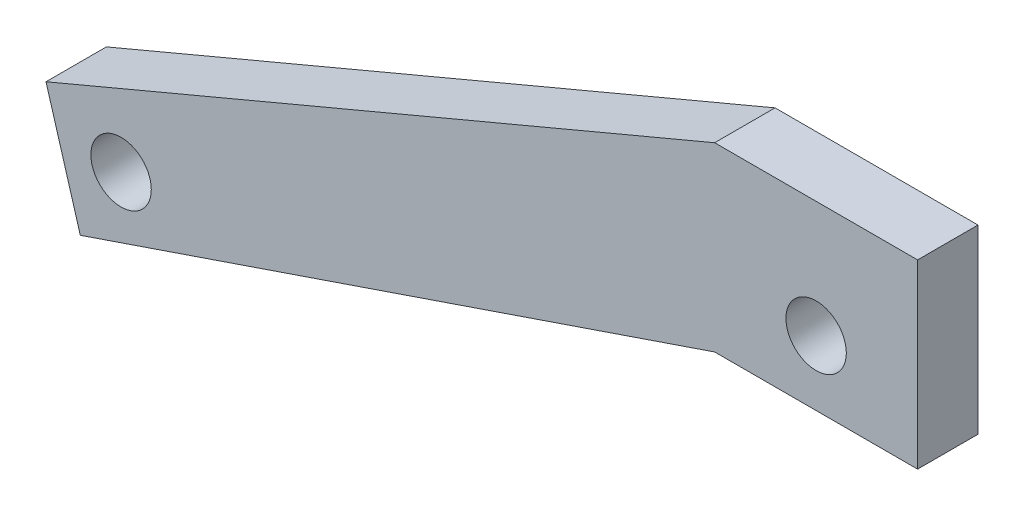
ISO-10303-21;
HEADER;
FILE_DESCRIPTION(('STEP AP214'),'2;1');
FILE_NAME('part.step','',(''),(''),'','','');
FILE_SCHEMA(('AUTOMOTIVE_DESIGN { 1 0 10303 214 1 1 1 1 }'));
ENDSEC;
DATA;
#1=APPLICATION_CONTEXT('core data for automotive mechanical design processes');
#2=APPLICATION_PROTOCOL_DEFINITION('international standard','automotive_design',2000,#1);
#3=PRODUCT_CONTEXT('',#1,'mechanical');
#4=PRODUCT('Part','Part','',(#3));
#5=PRODUCT_RELATED_PRODUCT_CATEGORY('part','',(#4));
#6=PRODUCT_DEFINITION_FORMATION('','',#4);
#7=PRODUCT_DEFINITION_CONTEXT('part definition',#1,'design');
#8=PRODUCT_DEFINITION('design','',#6,#7);
#9=PRODUCT_DEFINITION_SHAPE('','',#8);
#10=(LENGTH_UNIT() NAMED_UNIT(*) SI_UNIT(.MILLI.,.METRE.));
#11=(NAMED_UNIT(*) PLANE_ANGLE_UNIT() SI_UNIT($,.RADIAN.));
#12=(NAMED_UNIT(*) SI_UNIT($,.STERADIAN.) SOLID_ANGLE_UNIT());
#13=UNCERTAINTY_MEASURE_WITH_UNIT(LENGTH_MEASURE(1.E-05),#10,'distance_accuracy_value','');
#14=(GEOMETRIC_REPRESENTATION_CONTEXT(3) GLOBAL_UNCERTAINTY_ASSIGNED_CONTEXT((#13)) GLOBAL_UNIT_ASSIGNED_CONTEXT((#10,
#11,#12)) REPRESENTATION_CONTEXT('',''));
#15=CARTESIAN_POINT('',(0.,0.,0.));
#16=DIRECTION('',(0.,0.,1.));
#17=DIRECTION('',(1.,0.,0.));
#18=AXIS2_PLACEMENT_3D('',#15,#16,#17);
#19=CARTESIAN_POINT('',(-181.897226624623,-53.8804132223541,9.525));
#20=DIRECTION('',(-0.958819734868243,-0.284015344703754,0.));
#21=DIRECTION('',(0.284015344703754,-0.958819734868243,0.));
#22=AXIS2_PLACEMENT_3D('',#19,#20,#21);
#23=PLANE('',#22);
#24=DIRECTION('',(-0.284015344703754,0.958819734868243,0.));
#25=VECTOR('',#24,1.);
#26=CARTESIAN_POINT('',(-181.897226624623,-53.8804132223541,0.));
#27=LINE('',#26,#25);
#28=CARTESIAN_POINT('',(-211.250903159401,45.2159380041662,0.));
#29=VERTEX_POINT('',#28);
#30=CARTESIAN_POINT('',(-216.661395476008,63.4814539534063,0.));
#31=VERTEX_POINT('',#30);
#32=EDGE_CURVE('E130',#29,#31,#27,.T.);
#33=ORIENTED_EDGE('',*,*,#32,.F.);
#34=DIRECTION('',(0.,0.,-1.));
#35=VECTOR('',#34,1.);
#36=CARTESIAN_POINT('',(-211.250903159401,45.2159380041662,9.525));
#37=LINE('',#36,#35);
#38=CARTESIAN_POINT('',(-211.250903159401,45.2159380041662,9.525));
#39=VERTEX_POINT('',#38);
#40=EDGE_CURVE('E11',#39,#29,#37,.T.);
#41=ORIENTED_EDGE('',*,*,#40,.F.);
#42=DIRECTION('',(-0.284015344703754,0.958819734868243,0.));
#43=VECTOR('',#42,1.);
#44=CARTESIAN_POINT('',(-181.897226624623,-53.8804132223541,9.525));
#45=LINE('',#44,#43);
#46=CARTESIAN_POINT('',(-216.661395476008,63.4814539534063,9.525));
#47=VERTEX_POINT('',#46);
#48=EDGE_CURVE('E238',#39,#47,#45,.T.);
#49=ORIENTED_EDGE('',*,*,#48,.T.);
#50=DIRECTION('',(0.,0.,-1.));
#51=VECTOR('',#50,1.);
#52=CARTESIAN_POINT('',(-216.661395476008,63.4814539534063,9.525));
#53=LINE('',#52,#51);
#54=EDGE_CURVE('E80',#47,#31,#53,.T.);
#55=ORIENTED_EDGE('',*,*,#54,.T.);
#56=EDGE_LOOP('',(#33,#41,#49,#55));
#57=FACE_BOUND('',#56,.T.);
#58=ADVANCED_FACE('F35',(#57),#23,.T.);
#59=CARTESIAN_POINT('',(-35.7758008350263,105.002644647187,9.525));
#60=DIRECTION('',(0.322507916242878,-0.946566766773838,0.));
#61=DIRECTION('',(0.946566766773838,0.322507916242878,0.));
#62=AXIS2_PLACEMENT_3D('',#59,#60,#61);
#63=PLANE('',#62);
#64=DIRECTION('',(-0.946566766773838,-0.322507916242878,0.));
#65=VECTOR('',#64,1.);
#66=CARTESIAN_POINT('',(-35.7758008350263,105.002644647187,0.));
#67=LINE('',#66,#65);
#68=CARTESIAN_POINT('',(-111.230275822276,79.2942991257426,0.));
#69=VERTEX_POINT('',#68);
#70=EDGE_CURVE('E128',#69,#29,#67,.T.);
#71=ORIENTED_EDGE('',*,*,#70,.F.);
#72=DIRECTION('',(0.,0.,-1.));
#73=VECTOR('',#72,1.);
#74=CARTESIAN_POINT('',(-111.230275822276,79.2942991257426,9.525));
#75=LINE('',#74,#73);
#76=CARTESIAN_POINT('',(-111.230275822276,79.2942991257426,9.525));
#77=VERTEX_POINT('',#76);
#78=EDGE_CURVE('E44',#77,#69,#75,.T.);
#79=ORIENTED_EDGE('',*,*,#78,.F.);
#80=DIRECTION('',(-0.946566766773838,-0.322507916242878,0.));
#81=VECTOR('',#80,1.);
#82=CARTESIAN_POINT('',(-35.7758008350263,105.002644647187,9.525));
#83=LINE('',#82,#81);
#84=EDGE_CURVE('E239',#77,#39,#83,.T.);
#85=ORIENTED_EDGE('',*,*,#84,.T.);
#86=ORIENTED_EDGE('',*,*,#40,.T.);
#87=EDGE_LOOP('',(#71,#79,#85,#86));
#88=FACE_BOUND('',#87,.T.);
#89=ADVANCED_FACE('F129',(#88),#63,.T.);
#90=CARTESIAN_POINT('',(0.,79.2942991257426,9.525));
#91=DIRECTION('',(0.,-1.,0.));
#92=DIRECTION('',(1.,0.,0.));
#93=AXIS2_PLACEMENT_3D('',#90,#91,#92);
#94=PLANE('',#93);
#95=DIRECTION('',(-1.,0.,0.));
#96=VECTOR('',#95,1.);
#97=CARTESIAN_POINT('',(0.,79.2942991257426,0.));
#98=LINE('',#97,#96);
#99=CARTESIAN_POINT('',(-79.2302758222756,79.2942991257426,0.));
#100=VERTEX_POINT('',#99);
#101=EDGE_CURVE('E124',#100,#69,#98,.T.);
#102=ORIENTED_EDGE('',*,*,#101,.F.);
#103=DIRECTION('',(0.,0.,-1.));
#104=VECTOR('',#103,1.);
#105=CARTESIAN_POINT('',(-79.2302758222756,79.2942991257426,9.525));
#106=LINE('',#105,#104);
#107=CARTESIAN_POINT('',(-79.2302758222756,79.2942991257426,9.525));
#108=VERTEX_POINT('',#107);
#109=EDGE_CURVE('E114',#108,#100,#106,.T.);
#110=ORIENTED_EDGE('',*,*,#109,.F.);
#111=DIRECTION('',(-1.,0.,0.));
#112=VECTOR('',#111,1.);
#113=CARTESIAN_POINT('',(0.,79.2942991257426,9.525));
#114=LINE('',#113,#112);
#115=EDGE_CURVE('E108',#108,#77,#114,.T.);
#116=ORIENTED_EDGE('',*,*,#115,.T.);
#117=ORIENTED_EDGE('',*,*,#78,.T.);
#118=EDGE_LOOP('',(#102,#110,#116,#117));
#119=FACE_BOUND('',#118,.T.);
#120=ADVANCED_FACE('F122',(#119),#94,.T.);
#121=CARTESIAN_POINT('',(-79.2302758222756,0.,9.525));
#122=DIRECTION('',(-1.,0.,0.));
#123=DIRECTION('',(0.,-1.,0.));
#124=AXIS2_PLACEMENT_3D('',#121,#122,#123);
#125=PLANE('',#124);
#126=DIRECTION('',(0.,1.,0.));
#127=VECTOR('',#126,1.);
#128=CARTESIAN_POINT('',(-79.2302758222756,0.,0.));
#129=LINE('',#128,#127);
#130=CARTESIAN_POINT('',(-79.2302758222756,107.869299125743,0.));
#131=VERTEX_POINT('',#130);
#132=EDGE_CURVE('E113',#100,#131,#129,.T.);
#133=ORIENTED_EDGE('',*,*,#132,.T.);
#134=DIRECTION('',(0.,0.,-1.));
#135=VECTOR('',#134,1.);
#136=CARTESIAN_POINT('',(-79.2302758222756,107.869299125743,9.525));
#137=LINE('',#136,#135);
#138=CARTESIAN_POINT('',(-79.2302758222756,107.869299125743,9.525));
#139=VERTEX_POINT('',#138);
#140=EDGE_CURVE('E98',#139,#131,#137,.T.);
#141=ORIENTED_EDGE('',*,*,#140,.F.);
#142=DIRECTION('',(0.,1.,0.));
#143=VECTOR('',#142,1.);
#144=CARTESIAN_POINT('',(-79.2302758222756,0.,9.525));
#145=LINE('',#144,#143);
#146=EDGE_CURVE('E101',#108,#139,#145,.T.);
#147=ORIENTED_EDGE('',*,*,#146,.F.);
#148=ORIENTED_EDGE('',*,*,#109,.T.);
#149=EDGE_LOOP('',(#133,#141,#147,#148));
#150=FACE_BOUND('',#149,.T.);
#151=ADVANCED_FACE('F111',(#150),#125,.F.);
#152=CARTESIAN_POINT('',(1.77767235254067E-11,107.86929912573,9.525));
#153=DIRECTION('',(-1.64798730217823E-13,-1.,0.));
#154=DIRECTION('',(1.,-1.64798730217823E-13,0.));
#155=AXIS2_PLACEMENT_3D('',#152,#153,#154);
#156=PLANE('',#155);
#157=DIRECTION('',(-1.,1.64798730217823E-13,0.));
#158=VECTOR('',#157,1.);
#159=CARTESIAN_POINT('',(1.77767235254067E-11,107.86929912573,0.));
#160=LINE('',#159,#158);
#161=CARTESIAN_POINT('',(-111.230275822271,107.869299125748,0.));
#162=VERTEX_POINT('',#161);
#163=EDGE_CURVE('E134',#131,#162,#160,.T.);
#164=ORIENTED_EDGE('',*,*,#163,.T.);
#165=DIRECTION('',(0.,0.,-1.));
#166=VECTOR('',#165,1.);
#167=CARTESIAN_POINT('',(-111.230275822271,107.869299125748,9.525));
#168=LINE('',#167,#166);
#169=CARTESIAN_POINT('',(-111.230275822271,107.869299125748,9.525));
#170=VERTEX_POINT('',#169);
#171=EDGE_CURVE('E100',#170,#162,#168,.T.);
#172=ORIENTED_EDGE('',*,*,#171,.F.);
#173=DIRECTION('',(-1.,1.64798730217823E-13,0.));
#174=VECTOR('',#173,1.);
#175=CARTESIAN_POINT('',(1.77767235254067E-11,107.86929912573,9.525));
#176=LINE('',#175,#174);
#177=EDGE_CURVE('E93',#139,#170,#176,.T.);
#178=ORIENTED_EDGE('',*,*,#177,.F.);
#179=ORIENTED_EDGE('',*,*,#140,.T.);
#180=EDGE_LOOP('',(#164,#172,#178,#179));
#181=FACE_BOUND('',#180,.T.);
#182=ADVANCED_FACE('F96',(#181),#156,.F.);
#183=CARTESIAN_POINT('',(-95.2302956476441,89.5168960367285,9.525));
#184=DIRECTION('',(0.,0.,-1.));
#185=DIRECTION('',(-1.,0.,0.));
#186=AXIS2_PLACEMENT_3D('',#183,#184,#185);
#187=CYLINDRICAL_SURFACE('',#186,4.76250000164186);
#188=CARTESIAN_POINT('',(-95.2302956476441,89.5168960367285,9.525));
#189=DIRECTION('',(0.,0.,1.));
#190=DIRECTION('',(1.,0.,0.));
#191=AXIS2_PLACEMENT_3D('',#188,#189,#190);
#192=CIRCLE('',#191,4.76250000164186);
#193=CARTESIAN_POINT('',(-90.4677956460023,89.5168960367285,9.525));
#194=VERTEX_POINT('',#193);
#195=EDGE_CURVE('E167',#194,#194,#192,.T.);
#196=ORIENTED_EDGE('',*,*,#195,.T.);
#197=EDGE_LOOP('',(#196));
#198=FACE_BOUND('',#197,.T.);
#199=CARTESIAN_POINT('',(-95.2302956476441,89.5168960367285,0.));
#200=DIRECTION('',(0.,0.,1.));
#201=DIRECTION('',(1.,0.,0.));
#202=AXIS2_PLACEMENT_3D('',#199,#200,#201);
#203=CIRCLE('',#202,4.76250000164186);
#204=CARTESIAN_POINT('',(-90.4677956460023,89.5168960367285,0.));
#205=VERTEX_POINT('',#204);
#206=EDGE_CURVE('E145',#205,#205,#203,.T.);
#207=ORIENTED_EDGE('',*,*,#206,.F.);
#208=EDGE_LOOP('',(#207));
#209=FACE_BOUND('',#208,.T.);
#210=ADVANCED_FACE('F154',(#198,#209),#187,.F.);
#211=CARTESIAN_POINT('',(-204.823391343084,57.0539421370895,9.525));
#212=DIRECTION('',(0.,0.,-1.));
#213=DIRECTION('',(-1.,0.,0.));
#214=AXIS2_PLACEMENT_3D('',#211,#212,#213);
#215=CYLINDRICAL_SURFACE('',#214,4.76250000164186);
#216=CARTESIAN_POINT('',(-204.823391343084,57.0539421370895,9.525));
#217=DIRECTION('',(0.,0.,1.));
#218=DIRECTION('',(1.,0.,0.));
#219=AXIS2_PLACEMENT_3D('',#216,#217,#218);
#220=CIRCLE('',#219,4.76250000164186);
#221=CARTESIAN_POINT('',(-200.060891341442,57.0539421370895,9.525));
#222=VERTEX_POINT('',#221);
#223=EDGE_CURVE('E139',#222,#222,#220,.T.);
#224=ORIENTED_EDGE('',*,*,#223,.T.);
#225=EDGE_LOOP('',(#224));
#226=FACE_BOUND('',#225,.T.);
#227=CARTESIAN_POINT('',(-204.823391343084,57.0539421370895,0.));
#228=DIRECTION('',(0.,0.,1.));
#229=DIRECTION('',(1.,0.,0.));
#230=AXIS2_PLACEMENT_3D('',#227,#228,#229);
#231=CIRCLE('',#230,4.76250000164186);
#232=CARTESIAN_POINT('',(-200.060891341442,57.0539421370895,0.));
#233=VERTEX_POINT('',#232);
#234=EDGE_CURVE('E142',#233,#233,#231,.T.);
#235=ORIENTED_EDGE('',*,*,#234,.F.);
#236=EDGE_LOOP('',(#235));
#237=FACE_BOUND('',#236,.T.);
#238=ADVANCED_FACE('F37',(#226,#237),#215,.F.);
#239=CARTESIAN_POINT('',(-55.3238590191712,131.40661316876,9.525));
#240=DIRECTION('',(0.388025774847095,-0.921648521972618,0.));
#241=DIRECTION('',(0.921648521972618,0.388025774847095,0.));
#242=AXIS2_PLACEMENT_3D('',#239,#240,#241);
#243=PLANE('',#242);
#244=DIRECTION('',(-0.921648521972618,-0.388025774847095,0.));
#245=VECTOR('',#244,1.);
#246=CARTESIAN_POINT('',(-55.3238590191712,131.40661316876,0.));
#247=LINE('',#246,#245);
#248=EDGE_CURVE('E73',#162,#31,#247,.T.);
#249=ORIENTED_EDGE('',*,*,#248,.T.);
#250=ORIENTED_EDGE('',*,*,#54,.F.);
#251=DIRECTION('',(-0.921648521972618,-0.388025774847095,0.));
#252=VECTOR('',#251,1.);
#253=CARTESIAN_POINT('',(-55.3238590191712,131.40661316876,9.525));
#254=LINE('',#253,#252);
#255=EDGE_CURVE('E52',#170,#47,#254,.T.);
#256=ORIENTED_EDGE('',*,*,#255,.F.);
#257=ORIENTED_EDGE('',*,*,#171,.T.);
#258=EDGE_LOOP('',(#249,#250,#256,#257));
#259=FACE_BOUND('',#258,.T.);
#260=ADVANCED_FACE('F161',(#259),#243,.F.);
#261=CARTESIAN_POINT('',(0.,0.,9.525));
#262=DIRECTION('',(0.,0.,1.));
#263=DIRECTION('',(1.,0.,0.));
#264=AXIS2_PLACEMENT_3D('',#261,#262,#263);
#265=PLANE('',#264);
#266=ORIENTED_EDGE('',*,*,#223,.F.);
#267=EDGE_LOOP('',(#266));
#268=FACE_BOUND('',#267,.T.);
#269=ORIENTED_EDGE('',*,*,#195,.F.);
#270=EDGE_LOOP('',(#269));
#271=FACE_BOUND('',#270,.T.);
#272=ORIENTED_EDGE('',*,*,#48,.F.);
#273=ORIENTED_EDGE('',*,*,#84,.F.);
#274=ORIENTED_EDGE('',*,*,#115,.F.);
#275=ORIENTED_EDGE('',*,*,#146,.T.);
#276=ORIENTED_EDGE('',*,*,#177,.T.);
#277=ORIENTED_EDGE('',*,*,#255,.T.);
#278=EDGE_LOOP('',(#272,#273,#274,#275,#276,#277));
#279=FACE_BOUND('',#278,.T.);
#280=ADVANCED_FACE('F105',(#268,#271,#279),#265,.T.);
#281=CARTESIAN_POINT('',(0.,0.,0.));
#282=DIRECTION('',(0.,0.,1.));
#283=DIRECTION('',(1.,0.,0.));
#284=AXIS2_PLACEMENT_3D('',#281,#282,#283);
#285=PLANE('',#284);
#286=ORIENTED_EDGE('',*,*,#234,.T.);
#287=EDGE_LOOP('',(#286));
#288=FACE_BOUND('',#287,.T.);
#289=ORIENTED_EDGE('',*,*,#206,.T.);
#290=EDGE_LOOP('',(#289));
#291=FACE_BOUND('',#290,.T.);
#292=ORIENTED_EDGE('',*,*,#32,.T.);
#293=ORIENTED_EDGE('',*,*,#248,.F.);
#294=ORIENTED_EDGE('',*,*,#163,.F.);
#295=ORIENTED_EDGE('',*,*,#132,.F.);
#296=ORIENTED_EDGE('',*,*,#101,.T.);
#297=ORIENTED_EDGE('',*,*,#70,.T.);
#298=EDGE_LOOP('',(#292,#293,#294,#295,#296,#297));
#299=FACE_BOUND('',#298,.T.);
#300=ADVANCED_FACE('F132',(#288,#291,#299),#285,.F.);
#301=CLOSED_SHELL('',(#58,#89,#120,#151,#182,#210,#238,#260,#280,#300));
#302=MANIFOLD_SOLID_BREP('B2',#301);
#303=ADVANCED_BREP_SHAPE_REPRESENTATION('',(#18,#302),#14);
#304=SHAPE_DEFINITION_REPRESENTATION(#9,#303);
ENDSEC;
END-ISO-10303-21;
